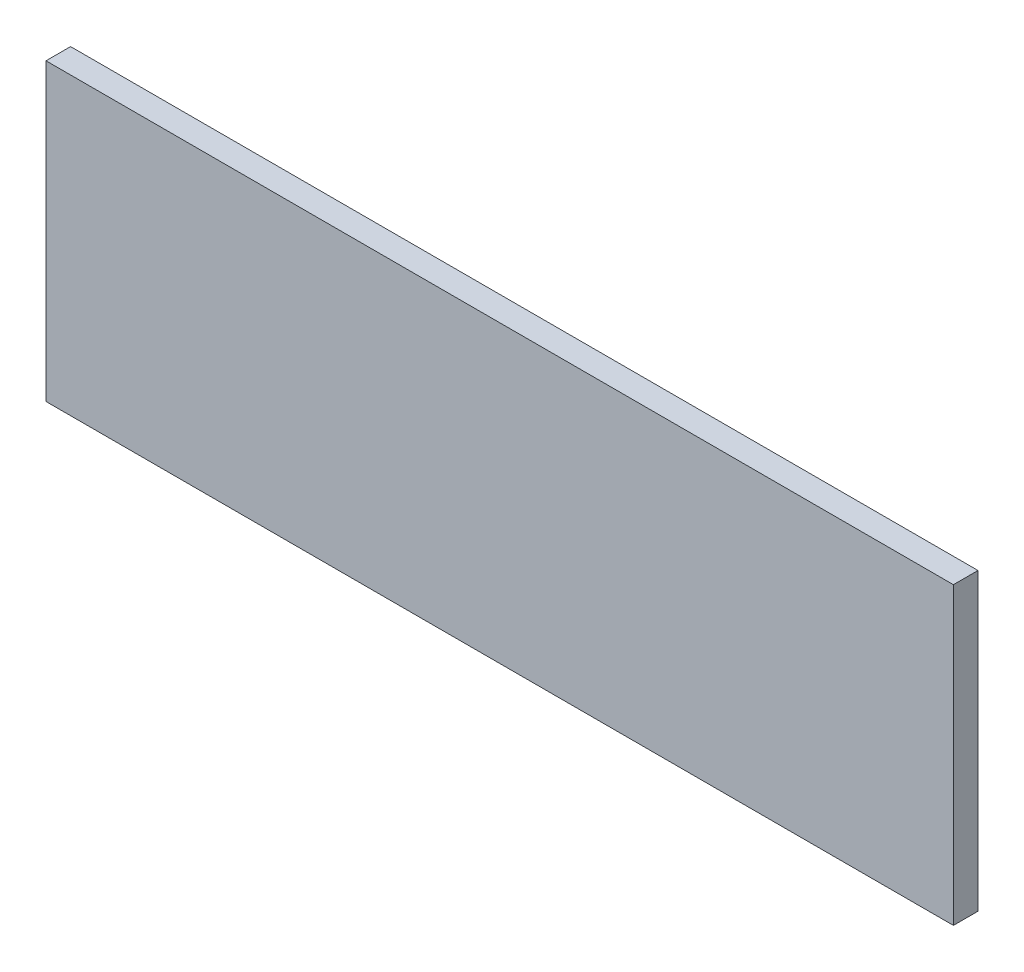
ISO-10303-21;
HEADER;
FILE_DESCRIPTION(('STEP AP214'),'2;1');
FILE_NAME('part.step','',(''),(''),'','','');
FILE_SCHEMA(('AUTOMOTIVE_DESIGN { 1 0 10303 214 1 1 1 1 }'));
ENDSEC;
DATA;
#1=APPLICATION_CONTEXT('core data for automotive mechanical design processes');
#2=APPLICATION_PROTOCOL_DEFINITION('international standard','automotive_design',2000,#1);
#3=PRODUCT_CONTEXT('',#1,'mechanical');
#4=PRODUCT('Part','Part','',(#3));
#5=PRODUCT_RELATED_PRODUCT_CATEGORY('part','',(#4));
#6=PRODUCT_DEFINITION_FORMATION('','',#4);
#7=PRODUCT_DEFINITION_CONTEXT('part definition',#1,'design');
#8=PRODUCT_DEFINITION('design','',#6,#7);
#9=PRODUCT_DEFINITION_SHAPE('','',#8);
#10=(LENGTH_UNIT() NAMED_UNIT(*) SI_UNIT(.MILLI.,.METRE.));
#11=(NAMED_UNIT(*) PLANE_ANGLE_UNIT() SI_UNIT($,.RADIAN.));
#12=(NAMED_UNIT(*) SI_UNIT($,.STERADIAN.) SOLID_ANGLE_UNIT());
#13=UNCERTAINTY_MEASURE_WITH_UNIT(LENGTH_MEASURE(1.E-05),#10,'distance_accuracy_value','');
#14=(GEOMETRIC_REPRESENTATION_CONTEXT(3) GLOBAL_UNCERTAINTY_ASSIGNED_CONTEXT((#13)) GLOBAL_UNIT_ASSIGNED_CONTEXT((#10,
#11,#12)) REPRESENTATION_CONTEXT('',''));
#15=CARTESIAN_POINT('',(0.,0.,0.));
#16=DIRECTION('',(0.,0.,1.));
#17=DIRECTION('',(1.,0.,0.));
#18=AXIS2_PLACEMENT_3D('',#15,#16,#17);
#19=CARTESIAN_POINT('',(0.,0.,1.25));
#20=DIRECTION('',(1.,0.,0.));
#21=DIRECTION('',(0.,0.,-1.));
#22=AXIS2_PLACEMENT_3D('',#19,#20,#21);
#23=PLANE('',#22);
#24=DIRECTION('',(0.,-1.,0.));
#25=VECTOR('',#24,1.);
#26=CARTESIAN_POINT('',(0.,0.,0.));
#27=LINE('',#26,#25);
#28=CARTESIAN_POINT('',(0.,15.,0.));
#29=VERTEX_POINT('',#28);
#30=CARTESIAN_POINT('',(0.,0.,0.));
#31=VERTEX_POINT('',#30);
#32=EDGE_CURVE('E96',#29,#31,#27,.T.);
#33=ORIENTED_EDGE('',*,*,#32,.T.);
#34=DIRECTION('',(0.,0.,-1.));
#35=VECTOR('',#34,1.);
#36=CARTESIAN_POINT('',(0.,0.,1.25));
#37=LINE('',#36,#35);
#38=CARTESIAN_POINT('',(0.,0.,1.25));
#39=VERTEX_POINT('',#38);
#40=EDGE_CURVE('E11',#39,#31,#37,.T.);
#41=ORIENTED_EDGE('',*,*,#40,.F.);
#42=DIRECTION('',(0.,-1.,0.));
#43=VECTOR('',#42,1.);
#44=CARTESIAN_POINT('',(0.,0.,1.25));
#45=LINE('',#44,#43);
#46=CARTESIAN_POINT('',(0.,15.,1.25));
#47=VERTEX_POINT('',#46);
#48=EDGE_CURVE('E84',#47,#39,#45,.T.);
#49=ORIENTED_EDGE('',*,*,#48,.F.);
#50=DIRECTION('',(0.,0.,-1.));
#51=VECTOR('',#50,1.);
#52=CARTESIAN_POINT('',(0.,15.,1.25));
#53=LINE('',#52,#51);
#54=EDGE_CURVE('E92',#47,#29,#53,.T.);
#55=ORIENTED_EDGE('',*,*,#54,.T.);
#56=EDGE_LOOP('',(#33,#41,#49,#55));
#57=FACE_BOUND('',#56,.T.);
#58=ADVANCED_FACE('F33',(#57),#23,.F.);
#59=CARTESIAN_POINT('',(0.,0.,1.25));
#60=DIRECTION('',(0.,1.,0.));
#61=DIRECTION('',(0.,0.,1.));
#62=AXIS2_PLACEMENT_3D('',#59,#60,#61);
#63=PLANE('',#62);
#64=DIRECTION('',(1.,0.,0.));
#65=VECTOR('',#64,1.);
#66=CARTESIAN_POINT('',(0.,0.,0.));
#67=LINE('',#66,#65);
#68=CARTESIAN_POINT('',(46.125,0.,0.));
#69=VERTEX_POINT('',#68);
#70=EDGE_CURVE('E88',#31,#69,#67,.T.);
#71=ORIENTED_EDGE('',*,*,#70,.T.);
#72=DIRECTION('',(0.,0.,-1.));
#73=VECTOR('',#72,1.);
#74=CARTESIAN_POINT('',(46.125,0.,1.25));
#75=LINE('',#74,#73);
#76=CARTESIAN_POINT('',(46.125,0.,1.25));
#77=VERTEX_POINT('',#76);
#78=EDGE_CURVE('E41',#77,#69,#75,.T.);
#79=ORIENTED_EDGE('',*,*,#78,.F.);
#80=DIRECTION('',(1.,0.,0.));
#81=VECTOR('',#80,1.);
#82=CARTESIAN_POINT('',(0.,0.,1.25));
#83=LINE('',#82,#81);
#84=EDGE_CURVE('E79',#39,#77,#83,.T.);
#85=ORIENTED_EDGE('',*,*,#84,.F.);
#86=ORIENTED_EDGE('',*,*,#40,.T.);
#87=EDGE_LOOP('',(#71,#79,#85,#86));
#88=FACE_BOUND('',#87,.T.);
#89=ADVANCED_FACE('F87',(#88),#63,.F.);
#90=CARTESIAN_POINT('',(46.125,0.,1.25));
#91=DIRECTION('',(-1.,0.,0.));
#92=DIRECTION('',(0.,0.,1.));
#93=AXIS2_PLACEMENT_3D('',#90,#91,#92);
#94=PLANE('',#93);
#95=DIRECTION('',(0.,1.,0.));
#96=VECTOR('',#95,1.);
#97=CARTESIAN_POINT('',(46.125,0.,0.));
#98=LINE('',#97,#96);
#99=CARTESIAN_POINT('',(46.125,15.,0.));
#100=VERTEX_POINT('',#99);
#101=EDGE_CURVE('E66',#69,#100,#98,.T.);
#102=ORIENTED_EDGE('',*,*,#101,.T.);
#103=DIRECTION('',(0.,0.,-1.));
#104=VECTOR('',#103,1.);
#105=CARTESIAN_POINT('',(46.125,15.,1.25));
#106=LINE('',#105,#104);
#107=CARTESIAN_POINT('',(46.125,15.,1.25));
#108=VERTEX_POINT('',#107);
#109=EDGE_CURVE('E89',#108,#100,#106,.T.);
#110=ORIENTED_EDGE('',*,*,#109,.F.);
#111=DIRECTION('',(0.,1.,0.));
#112=VECTOR('',#111,1.);
#113=CARTESIAN_POINT('',(46.125,0.,1.25));
#114=LINE('',#113,#112);
#115=EDGE_CURVE('E82',#77,#108,#114,.T.);
#116=ORIENTED_EDGE('',*,*,#115,.F.);
#117=ORIENTED_EDGE('',*,*,#78,.T.);
#118=EDGE_LOOP('',(#102,#110,#116,#117));
#119=FACE_BOUND('',#118,.T.);
#120=ADVANCED_FACE('F90',(#119),#94,.F.);
#121=CARTESIAN_POINT('',(0.,15.,1.25));
#122=DIRECTION('',(0.,-1.,0.));
#123=DIRECTION('',(0.,0.,-1.));
#124=AXIS2_PLACEMENT_3D('',#121,#122,#123);
#125=PLANE('',#124);
#126=DIRECTION('',(-1.,0.,0.));
#127=VECTOR('',#126,1.);
#128=CARTESIAN_POINT('',(0.,15.,0.));
#129=LINE('',#128,#127);
#130=EDGE_CURVE('E72',#100,#29,#129,.T.);
#131=ORIENTED_EDGE('',*,*,#130,.T.);
#132=ORIENTED_EDGE('',*,*,#54,.F.);
#133=DIRECTION('',(-1.,0.,0.));
#134=VECTOR('',#133,1.);
#135=CARTESIAN_POINT('',(0.,15.,1.25));
#136=LINE('',#135,#134);
#137=EDGE_CURVE('E49',#108,#47,#136,.T.);
#138=ORIENTED_EDGE('',*,*,#137,.F.);
#139=ORIENTED_EDGE('',*,*,#109,.T.);
#140=EDGE_LOOP('',(#131,#132,#138,#139));
#141=FACE_BOUND('',#140,.T.);
#142=ADVANCED_FACE('F103',(#141),#125,.F.);
#143=CARTESIAN_POINT('',(0.,0.,1.25));
#144=DIRECTION('',(0.,0.,-1.));
#145=DIRECTION('',(-1.,0.,0.));
#146=AXIS2_PLACEMENT_3D('',#143,#144,#145);
#147=PLANE('',#146);
#148=ORIENTED_EDGE('',*,*,#48,.T.);
#149=ORIENTED_EDGE('',*,*,#84,.T.);
#150=ORIENTED_EDGE('',*,*,#115,.T.);
#151=ORIENTED_EDGE('',*,*,#137,.T.);
#152=EDGE_LOOP('',(#148,#149,#150,#151));
#153=FACE_BOUND('',#152,.T.);
#154=ADVANCED_FACE('F80',(#153),#147,.F.);
#155=CARTESIAN_POINT('',(0.,0.,0.));
#156=DIRECTION('',(0.,0.,-1.));
#157=DIRECTION('',(-1.,0.,0.));
#158=AXIS2_PLACEMENT_3D('',#155,#156,#157);
#159=PLANE('',#158);
#160=ORIENTED_EDGE('',*,*,#32,.F.);
#161=ORIENTED_EDGE('',*,*,#130,.F.);
#162=ORIENTED_EDGE('',*,*,#101,.F.);
#163=ORIENTED_EDGE('',*,*,#70,.F.);
#164=EDGE_LOOP('',(#160,#161,#162,#163));
#165=FACE_BOUND('',#164,.T.);
#166=ADVANCED_FACE('F106',(#165),#159,.T.);
#167=CLOSED_SHELL('',(#58,#89,#120,#142,#154,#166));
#168=MANIFOLD_SOLID_BREP('B2',#167);
#169=ADVANCED_BREP_SHAPE_REPRESENTATION('',(#18,#168),#14);
#170=SHAPE_DEFINITION_REPRESENTATION(#9,#169);
ENDSEC;
END-ISO-10303-21;
